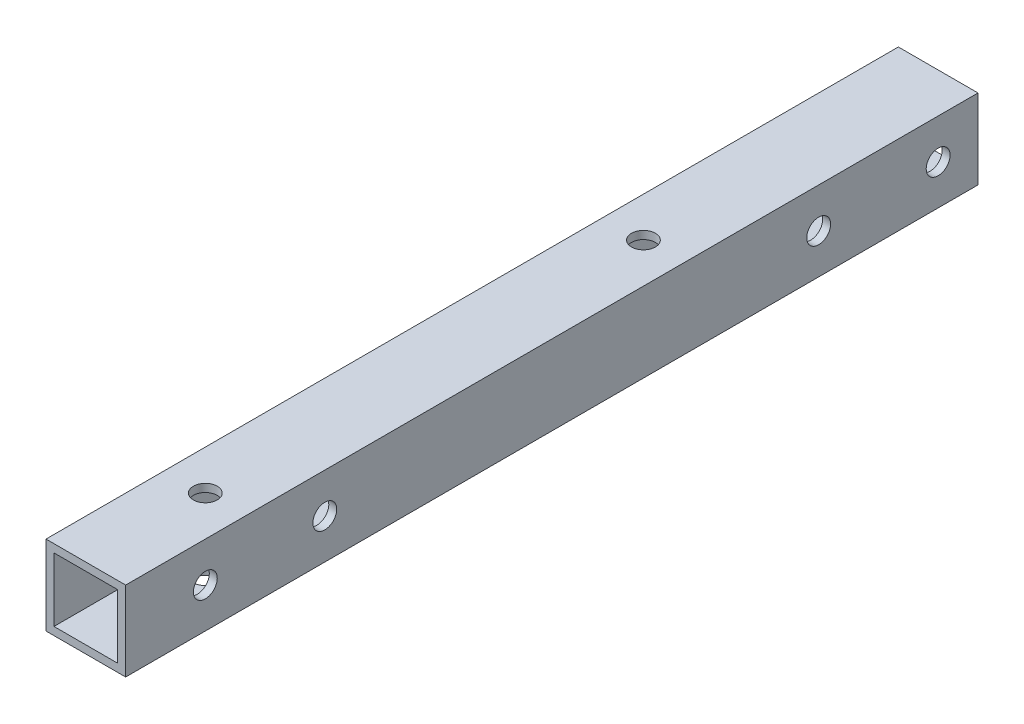
ISO-10303-21;
HEADER;
FILE_DESCRIPTION(('STEP AP214'),'2;1');
FILE_NAME('part.step','',(''),(''),'','','');
FILE_SCHEMA(('AUTOMOTIVE_DESIGN { 1 0 10303 214 1 1 1 1 }'));
ENDSEC;
DATA;
#1=APPLICATION_CONTEXT('core data for automotive mechanical design processes');
#2=APPLICATION_PROTOCOL_DEFINITION('international standard','automotive_design',2000,#1);
#3=PRODUCT_CONTEXT('',#1,'mechanical');
#4=PRODUCT('Part','Part','',(#3));
#5=PRODUCT_RELATED_PRODUCT_CATEGORY('part','',(#4));
#6=PRODUCT_DEFINITION_FORMATION('','',#4);
#7=PRODUCT_DEFINITION_CONTEXT('part definition',#1,'design');
#8=PRODUCT_DEFINITION('design','',#6,#7);
#9=PRODUCT_DEFINITION_SHAPE('','',#8);
#10=(LENGTH_UNIT() NAMED_UNIT(*) SI_UNIT(.MILLI.,.METRE.));
#11=(NAMED_UNIT(*) PLANE_ANGLE_UNIT() SI_UNIT($,.RADIAN.));
#12=(NAMED_UNIT(*) SI_UNIT($,.STERADIAN.) SOLID_ANGLE_UNIT());
#13=UNCERTAINTY_MEASURE_WITH_UNIT(LENGTH_MEASURE(1.E-05),#10,'distance_accuracy_value','');
#14=(GEOMETRIC_REPRESENTATION_CONTEXT(3) GLOBAL_UNCERTAINTY_ASSIGNED_CONTEXT((#13)) GLOBAL_UNIT_ASSIGNED_CONTEXT((#10,
#11,#12)) REPRESENTATION_CONTEXT('',''));
#15=CARTESIAN_POINT('',(0.,0.,0.));
#16=DIRECTION('',(0.,0.,1.));
#17=DIRECTION('',(1.,0.,0.));
#18=AXIS2_PLACEMENT_3D('',#15,#16,#17);
#19=CARTESIAN_POINT('',(0.,0.,107.));
#20=DIRECTION('',(0.,0.,1.));
#21=DIRECTION('',(1.,0.,0.));
#22=AXIS2_PLACEMENT_3D('',#19,#20,#21);
#23=PLANE('',#22);
#24=DIRECTION('',(0.,-1.,0.));
#25=VECTOR('',#24,1.);
#26=CARTESIAN_POINT('',(-5.,-5.,107.));
#27=LINE('',#26,#25);
#28=CARTESIAN_POINT('',(-5.,5.,107.));
#29=VERTEX_POINT('',#28);
#30=CARTESIAN_POINT('',(-5.,-5.,107.));
#31=VERTEX_POINT('',#30);
#32=EDGE_CURVE('E172',#29,#31,#27,.T.);
#33=ORIENTED_EDGE('',*,*,#32,.T.);
#34=DIRECTION('',(1.,0.,0.));
#35=VECTOR('',#34,1.);
#36=CARTESIAN_POINT('',(-5.,-5.,107.));
#37=LINE('',#36,#35);
#38=CARTESIAN_POINT('',(5.,-5.,107.));
#39=VERTEX_POINT('',#38);
#40=EDGE_CURVE('E175',#31,#39,#37,.T.);
#41=ORIENTED_EDGE('',*,*,#40,.T.);
#42=DIRECTION('',(0.,1.,0.));
#43=VECTOR('',#42,1.);
#44=CARTESIAN_POINT('',(5.,-5.,107.));
#45=LINE('',#44,#43);
#46=CARTESIAN_POINT('',(5.,5.,107.));
#47=VERTEX_POINT('',#46);
#48=EDGE_CURVE('E178',#39,#47,#45,.T.);
#49=ORIENTED_EDGE('',*,*,#48,.T.);
#50=DIRECTION('',(-1.,0.,0.));
#51=VECTOR('',#50,1.);
#52=CARTESIAN_POINT('',(-5.,5.,107.));
#53=LINE('',#52,#51);
#54=EDGE_CURVE('E180',#47,#29,#53,.T.);
#55=ORIENTED_EDGE('',*,*,#54,.T.);
#56=EDGE_LOOP('',(#33,#41,#49,#55));
#57=FACE_BOUND('',#56,.T.);
#58=DIRECTION('',(1.,0.,0.));
#59=VECTOR('',#58,1.);
#60=CARTESIAN_POINT('',(0.,-4.,107.));
#61=LINE('',#60,#59);
#62=CARTESIAN_POINT('',(-4.,-4.,107.));
#63=VERTEX_POINT('',#62);
#64=CARTESIAN_POINT('',(4.,-4.,107.));
#65=VERTEX_POINT('',#64);
#66=EDGE_CURVE('E142',#63,#65,#61,.T.);
#67=ORIENTED_EDGE('',*,*,#66,.F.);
#68=DIRECTION('',(0.,-1.,0.));
#69=VECTOR('',#68,1.);
#70=CARTESIAN_POINT('',(-4.,0.,107.));
#71=LINE('',#70,#69);
#72=CARTESIAN_POINT('',(-4.,4.,107.));
#73=VERTEX_POINT('',#72);
#74=EDGE_CURVE('E134',#73,#63,#71,.T.);
#75=ORIENTED_EDGE('',*,*,#74,.F.);
#76=DIRECTION('',(-1.,0.,0.));
#77=VECTOR('',#76,1.);
#78=CARTESIAN_POINT('',(0.,4.,107.));
#79=LINE('',#78,#77);
#80=CARTESIAN_POINT('',(4.,4.,107.));
#81=VERTEX_POINT('',#80);
#82=EDGE_CURVE('E156',#81,#73,#79,.T.);
#83=ORIENTED_EDGE('',*,*,#82,.F.);
#84=DIRECTION('',(0.,1.,0.));
#85=VECTOR('',#84,1.);
#86=CARTESIAN_POINT('',(4.,0.,107.));
#87=LINE('',#86,#85);
#88=EDGE_CURVE('E154',#65,#81,#87,.T.);
#89=ORIENTED_EDGE('',*,*,#88,.F.);
#90=EDGE_LOOP('',(#67,#75,#83,#89));
#91=FACE_BOUND('',#90,.T.);
#92=ADVANCED_FACE('F67',(#57,#91),#23,.T.);
#93=CARTESIAN_POINT('',(0.,0.,0.));
#94=DIRECTION('',(0.,0.,1.));
#95=DIRECTION('',(1.,0.,0.));
#96=AXIS2_PLACEMENT_3D('',#93,#94,#95);
#97=PLANE('',#96);
#98=DIRECTION('',(0.,-1.,0.));
#99=VECTOR('',#98,1.);
#100=CARTESIAN_POINT('',(-5.,-5.,0.));
#101=LINE('',#100,#99);
#102=CARTESIAN_POINT('',(-5.,5.,0.));
#103=VERTEX_POINT('',#102);
#104=CARTESIAN_POINT('',(-5.,-5.,0.));
#105=VERTEX_POINT('',#104);
#106=EDGE_CURVE('E150',#103,#105,#101,.T.);
#107=ORIENTED_EDGE('',*,*,#106,.F.);
#108=DIRECTION('',(-1.,0.,0.));
#109=VECTOR('',#108,1.);
#110=CARTESIAN_POINT('',(-5.,5.,0.));
#111=LINE('',#110,#109);
#112=CARTESIAN_POINT('',(5.,5.,0.));
#113=VERTEX_POINT('',#112);
#114=EDGE_CURVE('E176',#113,#103,#111,.T.);
#115=ORIENTED_EDGE('',*,*,#114,.F.);
#116=DIRECTION('',(0.,1.,0.));
#117=VECTOR('',#116,1.);
#118=CARTESIAN_POINT('',(5.,-5.,0.));
#119=LINE('',#118,#117);
#120=CARTESIAN_POINT('',(5.,-5.,0.));
#121=VERTEX_POINT('',#120);
#122=EDGE_CURVE('E187',#121,#113,#119,.T.);
#123=ORIENTED_EDGE('',*,*,#122,.F.);
#124=DIRECTION('',(1.,0.,0.));
#125=VECTOR('',#124,1.);
#126=CARTESIAN_POINT('',(-5.,-5.,0.));
#127=LINE('',#126,#125);
#128=EDGE_CURVE('E185',#105,#121,#127,.T.);
#129=ORIENTED_EDGE('',*,*,#128,.F.);
#130=EDGE_LOOP('',(#107,#115,#123,#129));
#131=FACE_BOUND('',#130,.T.);
#132=DIRECTION('',(0.,-1.,0.));
#133=VECTOR('',#132,1.);
#134=CARTESIAN_POINT('',(-4.,0.,0.));
#135=LINE('',#134,#133);
#136=CARTESIAN_POINT('',(-4.,4.,0.));
#137=VERTEX_POINT('',#136);
#138=CARTESIAN_POINT('',(-4.,-4.,0.));
#139=VERTEX_POINT('',#138);
#140=EDGE_CURVE('E92',#137,#139,#135,.T.);
#141=ORIENTED_EDGE('',*,*,#140,.T.);
#142=DIRECTION('',(1.,0.,0.));
#143=VECTOR('',#142,1.);
#144=CARTESIAN_POINT('',(0.,-4.,0.));
#145=LINE('',#144,#143);
#146=CARTESIAN_POINT('',(4.,-4.,0.));
#147=VERTEX_POINT('',#146);
#148=EDGE_CURVE('E149',#139,#147,#145,.T.);
#149=ORIENTED_EDGE('',*,*,#148,.T.);
#150=DIRECTION('',(0.,1.,0.));
#151=VECTOR('',#150,1.);
#152=CARTESIAN_POINT('',(4.,0.,0.));
#153=LINE('',#152,#151);
#154=CARTESIAN_POINT('',(4.,4.,0.));
#155=VERTEX_POINT('',#154);
#156=EDGE_CURVE('E164',#147,#155,#153,.T.);
#157=ORIENTED_EDGE('',*,*,#156,.T.);
#158=DIRECTION('',(-1.,0.,0.));
#159=VECTOR('',#158,1.);
#160=CARTESIAN_POINT('',(0.,4.,0.));
#161=LINE('',#160,#159);
#162=EDGE_CURVE('E143',#155,#137,#161,.T.);
#163=ORIENTED_EDGE('',*,*,#162,.T.);
#164=EDGE_LOOP('',(#141,#149,#157,#163));
#165=FACE_BOUND('',#164,.T.);
#166=ADVANCED_FACE('F293',(#131,#165),#97,.F.);
#167=CARTESIAN_POINT('',(-5.,-5.,107.));
#168=DIRECTION('',(1.,0.,0.));
#169=DIRECTION('',(0.,0.,-1.));
#170=AXIS2_PLACEMENT_3D('',#167,#168,#169);
#171=PLANE('',#170);
#172=CARTESIAN_POINT('',(-5.,0.,5.));
#173=DIRECTION('',(1.,0.,0.));
#174=DIRECTION('',(0.,0.,-1.));
#175=AXIS2_PLACEMENT_3D('',#172,#173,#174);
#176=CIRCLE('',#175,1.5);
#177=CARTESIAN_POINT('',(-5.,0.,3.5));
#178=VERTEX_POINT('',#177);
#179=EDGE_CURVE('E201',#178,#178,#176,.T.);
#180=ORIENTED_EDGE('',*,*,#179,.T.);
#181=EDGE_LOOP('',(#180));
#182=FACE_BOUND('',#181,.T.);
#183=CARTESIAN_POINT('',(-5.,0.,82.));
#184=DIRECTION('',(1.,0.,0.));
#185=DIRECTION('',(0.,0.,-1.));
#186=AXIS2_PLACEMENT_3D('',#183,#184,#185);
#187=CIRCLE('',#186,1.5);
#188=CARTESIAN_POINT('',(-5.,0.,80.5));
#189=VERTEX_POINT('',#188);
#190=EDGE_CURVE('E237',#189,#189,#187,.T.);
#191=ORIENTED_EDGE('',*,*,#190,.T.);
#192=EDGE_LOOP('',(#191));
#193=FACE_BOUND('',#192,.T.);
#194=CARTESIAN_POINT('',(-5.,0.,97.));
#195=DIRECTION('',(1.,0.,0.));
#196=DIRECTION('',(0.,0.,-1.));
#197=AXIS2_PLACEMENT_3D('',#194,#195,#196);
#198=CIRCLE('',#197,1.5);
#199=CARTESIAN_POINT('',(-5.,0.,95.5));
#200=VERTEX_POINT('',#199);
#201=EDGE_CURVE('E247',#200,#200,#198,.T.);
#202=ORIENTED_EDGE('',*,*,#201,.T.);
#203=EDGE_LOOP('',(#202));
#204=FACE_BOUND('',#203,.T.);
#205=CARTESIAN_POINT('',(-5.,0.,20.));
#206=DIRECTION('',(1.,0.,0.));
#207=DIRECTION('',(0.,0.,-1.));
#208=AXIS2_PLACEMENT_3D('',#205,#206,#207);
#209=CIRCLE('',#208,1.5);
#210=CARTESIAN_POINT('',(-5.,0.,18.5));
#211=VERTEX_POINT('',#210);
#212=EDGE_CURVE('E252',#211,#211,#209,.T.);
#213=ORIENTED_EDGE('',*,*,#212,.T.);
#214=EDGE_LOOP('',(#213));
#215=FACE_BOUND('',#214,.T.);
#216=ORIENTED_EDGE('',*,*,#106,.T.);
#217=DIRECTION('',(0.,0.,-1.));
#218=VECTOR('',#217,1.);
#219=CARTESIAN_POINT('',(-5.,-5.,107.));
#220=LINE('',#219,#218);
#221=EDGE_CURVE('E12',#31,#105,#220,.T.);
#222=ORIENTED_EDGE('',*,*,#221,.F.);
#223=ORIENTED_EDGE('',*,*,#32,.F.);
#224=DIRECTION('',(0.,0.,-1.));
#225=VECTOR('',#224,1.);
#226=CARTESIAN_POINT('',(-5.,5.,107.));
#227=LINE('',#226,#225);
#228=EDGE_CURVE('E182',#29,#103,#227,.T.);
#229=ORIENTED_EDGE('',*,*,#228,.T.);
#230=EDGE_LOOP('',(#216,#222,#223,#229));
#231=FACE_BOUND('',#230,.T.);
#232=ADVANCED_FACE('F69',(#182,#193,#204,#215,#231),#171,.F.);
#233=CARTESIAN_POINT('',(-5.,-5.,107.));
#234=DIRECTION('',(0.,1.,0.));
#235=DIRECTION('',(0.,0.,1.));
#236=AXIS2_PLACEMENT_3D('',#233,#234,#235);
#237=PLANE('',#236);
#238=CARTESIAN_POINT('',(0.,-5.,92.));
#239=DIRECTION('',(0.,-1.,0.));
#240=DIRECTION('',(0.,0.,-1.));
#241=AXIS2_PLACEMENT_3D('',#238,#239,#240);
#242=CIRCLE('',#241,1.5);
#243=CARTESIAN_POINT('',(0.,-5.,90.5));
#244=VERTEX_POINT('',#243);
#245=EDGE_CURVE('E221',#244,#244,#242,.T.);
#246=ORIENTED_EDGE('',*,*,#245,.F.);
#247=EDGE_LOOP('',(#246));
#248=FACE_BOUND('',#247,.T.);
#249=CARTESIAN_POINT('',(0.,-5.,37.));
#250=DIRECTION('',(0.,-1.,0.));
#251=DIRECTION('',(0.,0.,-1.));
#252=AXIS2_PLACEMENT_3D('',#249,#250,#251);
#253=CIRCLE('',#252,1.5);
#254=CARTESIAN_POINT('',(0.,-5.,35.5));
#255=VERTEX_POINT('',#254);
#256=EDGE_CURVE('E226',#255,#255,#253,.T.);
#257=ORIENTED_EDGE('',*,*,#256,.F.);
#258=EDGE_LOOP('',(#257));
#259=FACE_BOUND('',#258,.T.);
#260=ORIENTED_EDGE('',*,*,#128,.T.);
#261=DIRECTION('',(0.,0.,-1.));
#262=VECTOR('',#261,1.);
#263=CARTESIAN_POINT('',(5.,-5.,107.));
#264=LINE('',#263,#262);
#265=EDGE_CURVE('E76',#39,#121,#264,.T.);
#266=ORIENTED_EDGE('',*,*,#265,.F.);
#267=ORIENTED_EDGE('',*,*,#40,.F.);
#268=ORIENTED_EDGE('',*,*,#221,.T.);
#269=EDGE_LOOP('',(#260,#266,#267,#268));
#270=FACE_BOUND('',#269,.T.);
#271=ADVANCED_FACE('F292',(#248,#259,#270),#237,.F.);
#272=CARTESIAN_POINT('',(5.,-5.,107.));
#273=DIRECTION('',(-1.,0.,0.));
#274=DIRECTION('',(0.,0.,1.));
#275=AXIS2_PLACEMENT_3D('',#272,#273,#274);
#276=PLANE('',#275);
#277=CARTESIAN_POINT('',(5.,0.,5.));
#278=DIRECTION('',(1.,0.,0.));
#279=DIRECTION('',(0.,0.,-1.));
#280=AXIS2_PLACEMENT_3D('',#277,#278,#279);
#281=CIRCLE('',#280,1.5);
#282=CARTESIAN_POINT('',(5.,0.,3.5));
#283=VERTEX_POINT('',#282);
#284=EDGE_CURVE('E240',#283,#283,#281,.T.);
#285=ORIENTED_EDGE('',*,*,#284,.F.);
#286=EDGE_LOOP('',(#285));
#287=FACE_BOUND('',#286,.T.);
#288=CARTESIAN_POINT('',(5.,0.,82.));
#289=DIRECTION('',(1.,0.,0.));
#290=DIRECTION('',(0.,0.,-1.));
#291=AXIS2_PLACEMENT_3D('',#288,#289,#290);
#292=CIRCLE('',#291,1.5);
#293=CARTESIAN_POINT('',(5.,0.,80.5));
#294=VERTEX_POINT('',#293);
#295=EDGE_CURVE('E244',#294,#294,#292,.T.);
#296=ORIENTED_EDGE('',*,*,#295,.F.);
#297=EDGE_LOOP('',(#296));
#298=FACE_BOUND('',#297,.T.);
#299=CARTESIAN_POINT('',(5.,0.,97.));
#300=DIRECTION('',(1.,0.,0.));
#301=DIRECTION('',(0.,0.,-1.));
#302=AXIS2_PLACEMENT_3D('',#299,#300,#301);
#303=CIRCLE('',#302,1.5);
#304=CARTESIAN_POINT('',(5.,0.,95.5));
#305=VERTEX_POINT('',#304);
#306=EDGE_CURVE('E255',#305,#305,#303,.T.);
#307=ORIENTED_EDGE('',*,*,#306,.F.);
#308=EDGE_LOOP('',(#307));
#309=FACE_BOUND('',#308,.T.);
#310=CARTESIAN_POINT('',(5.,0.,20.));
#311=DIRECTION('',(1.,0.,0.));
#312=DIRECTION('',(0.,0.,-1.));
#313=AXIS2_PLACEMENT_3D('',#310,#311,#312);
#314=CIRCLE('',#313,1.5);
#315=CARTESIAN_POINT('',(5.,0.,18.5));
#316=VERTEX_POINT('',#315);
#317=EDGE_CURVE('E243',#316,#316,#314,.T.);
#318=ORIENTED_EDGE('',*,*,#317,.F.);
#319=EDGE_LOOP('',(#318));
#320=FACE_BOUND('',#319,.T.);
#321=ORIENTED_EDGE('',*,*,#122,.T.);
#322=DIRECTION('',(0.,0.,-1.));
#323=VECTOR('',#322,1.);
#324=CARTESIAN_POINT('',(5.,5.,107.));
#325=LINE('',#324,#323);
#326=EDGE_CURVE('E192',#47,#113,#325,.T.);
#327=ORIENTED_EDGE('',*,*,#326,.F.);
#328=ORIENTED_EDGE('',*,*,#48,.F.);
#329=ORIENTED_EDGE('',*,*,#265,.T.);
#330=EDGE_LOOP('',(#321,#327,#328,#329));
#331=FACE_BOUND('',#330,.T.);
#332=ADVANCED_FACE('F311',(#287,#298,#309,#320,#331),#276,.F.);
#333=CARTESIAN_POINT('',(-5.,5.,107.));
#334=DIRECTION('',(0.,-1.,0.));
#335=DIRECTION('',(0.,0.,-1.));
#336=AXIS2_PLACEMENT_3D('',#333,#334,#335);
#337=PLANE('',#336);
#338=CARTESIAN_POINT('',(0.,5.,92.));
#339=DIRECTION('',(0.,-1.,0.));
#340=DIRECTION('',(0.,0.,-1.));
#341=AXIS2_PLACEMENT_3D('',#338,#339,#340);
#342=CIRCLE('',#341,1.5);
#343=CARTESIAN_POINT('',(0.,5.,90.5));
#344=VERTEX_POINT('',#343);
#345=EDGE_CURVE('E215',#344,#344,#342,.T.);
#346=ORIENTED_EDGE('',*,*,#345,.T.);
#347=EDGE_LOOP('',(#346));
#348=FACE_BOUND('',#347,.T.);
#349=CARTESIAN_POINT('',(0.,5.,37.));
#350=DIRECTION('',(0.,-1.,0.));
#351=DIRECTION('',(0.,0.,-1.));
#352=AXIS2_PLACEMENT_3D('',#349,#350,#351);
#353=CIRCLE('',#352,1.5);
#354=CARTESIAN_POINT('',(0.,5.,35.5));
#355=VERTEX_POINT('',#354);
#356=EDGE_CURVE('E231',#355,#355,#353,.T.);
#357=ORIENTED_EDGE('',*,*,#356,.T.);
#358=EDGE_LOOP('',(#357));
#359=FACE_BOUND('',#358,.T.);
#360=ORIENTED_EDGE('',*,*,#114,.T.);
#361=ORIENTED_EDGE('',*,*,#228,.F.);
#362=ORIENTED_EDGE('',*,*,#54,.F.);
#363=ORIENTED_EDGE('',*,*,#326,.T.);
#364=EDGE_LOOP('',(#360,#361,#362,#363));
#365=FACE_BOUND('',#364,.T.);
#366=ADVANCED_FACE('F273',(#348,#359,#365),#337,.F.);
#367=CARTESIAN_POINT('',(-4.,0.,107.));
#368=DIRECTION('',(1.,0.,0.));
#369=DIRECTION('',(0.,0.,-1.));
#370=AXIS2_PLACEMENT_3D('',#367,#368,#369);
#371=PLANE('',#370);
#372=CARTESIAN_POINT('',(-4.,0.,5.));
#373=DIRECTION('',(1.,0.,0.));
#374=DIRECTION('',(0.,0.,-1.));
#375=AXIS2_PLACEMENT_3D('',#372,#373,#374);
#376=CIRCLE('',#375,1.5);
#377=CARTESIAN_POINT('',(-4.,0.,3.5));
#378=VERTEX_POINT('',#377);
#379=EDGE_CURVE('E162',#378,#378,#376,.T.);
#380=ORIENTED_EDGE('',*,*,#379,.F.);
#381=EDGE_LOOP('',(#380));
#382=FACE_BOUND('',#381,.T.);
#383=CARTESIAN_POINT('',(-4.,0.,82.));
#384=DIRECTION('',(1.,0.,0.));
#385=DIRECTION('',(0.,0.,-1.));
#386=AXIS2_PLACEMENT_3D('',#383,#384,#385);
#387=CIRCLE('',#386,1.5);
#388=CARTESIAN_POINT('',(-4.,0.,80.5));
#389=VERTEX_POINT('',#388);
#390=EDGE_CURVE('E209',#389,#389,#387,.T.);
#391=ORIENTED_EDGE('',*,*,#390,.F.);
#392=EDGE_LOOP('',(#391));
#393=FACE_BOUND('',#392,.T.);
#394=CARTESIAN_POINT('',(-4.,0.,97.));
#395=DIRECTION('',(1.,0.,0.));
#396=DIRECTION('',(0.,0.,-1.));
#397=AXIS2_PLACEMENT_3D('',#394,#395,#396);
#398=CIRCLE('',#397,1.5);
#399=CARTESIAN_POINT('',(-4.,0.,95.5));
#400=VERTEX_POINT('',#399);
#401=EDGE_CURVE('E205',#400,#400,#398,.T.);
#402=ORIENTED_EDGE('',*,*,#401,.F.);
#403=EDGE_LOOP('',(#402));
#404=FACE_BOUND('',#403,.T.);
#405=CARTESIAN_POINT('',(-4.,0.,20.));
#406=DIRECTION('',(1.,0.,0.));
#407=DIRECTION('',(0.,0.,-1.));
#408=AXIS2_PLACEMENT_3D('',#405,#406,#407);
#409=CIRCLE('',#408,1.5);
#410=CARTESIAN_POINT('',(-4.,0.,18.5));
#411=VERTEX_POINT('',#410);
#412=EDGE_CURVE('E200',#411,#411,#409,.T.);
#413=ORIENTED_EDGE('',*,*,#412,.F.);
#414=EDGE_LOOP('',(#413));
#415=FACE_BOUND('',#414,.T.);
#416=ORIENTED_EDGE('',*,*,#140,.F.);
#417=DIRECTION('',(0.,0.,-1.));
#418=VECTOR('',#417,1.);
#419=CARTESIAN_POINT('',(-4.,4.,107.));
#420=LINE('',#419,#418);
#421=EDGE_CURVE('E138',#73,#137,#420,.T.);
#422=ORIENTED_EDGE('',*,*,#421,.F.);
#423=ORIENTED_EDGE('',*,*,#74,.T.);
#424=DIRECTION('',(0.,0.,-1.));
#425=VECTOR('',#424,1.);
#426=CARTESIAN_POINT('',(-4.,-4.,107.));
#427=LINE('',#426,#425);
#428=EDGE_CURVE('E137',#63,#139,#427,.T.);
#429=ORIENTED_EDGE('',*,*,#428,.T.);
#430=EDGE_LOOP('',(#416,#422,#423,#429));
#431=FACE_BOUND('',#430,.T.);
#432=ADVANCED_FACE('F136',(#382,#393,#404,#415,#431),#371,.T.);
#433=CARTESIAN_POINT('',(0.,-4.,107.));
#434=DIRECTION('',(0.,1.,0.));
#435=DIRECTION('',(0.,0.,1.));
#436=AXIS2_PLACEMENT_3D('',#433,#434,#435);
#437=PLANE('',#436);
#438=CARTESIAN_POINT('',(0.,-4.00000000000001,92.));
#439=DIRECTION('',(0.,1.,0.));
#440=DIRECTION('',(0.,0.,1.));
#441=AXIS2_PLACEMENT_3D('',#438,#439,#440);
#442=CIRCLE('',#441,1.5);
#443=CARTESIAN_POINT('',(0.,-4.00000000000001,93.5));
#444=VERTEX_POINT('',#443);
#445=EDGE_CURVE('E234',#444,#444,#442,.T.);
#446=ORIENTED_EDGE('',*,*,#445,.F.);
#447=EDGE_LOOP('',(#446));
#448=FACE_BOUND('',#447,.T.);
#449=CARTESIAN_POINT('',(0.,-4.00000000000001,37.));
#450=DIRECTION('',(0.,1.,0.));
#451=DIRECTION('',(0.,0.,1.));
#452=AXIS2_PLACEMENT_3D('',#449,#450,#451);
#453=CIRCLE('',#452,1.5);
#454=CARTESIAN_POINT('',(0.,-4.00000000000001,38.5));
#455=VERTEX_POINT('',#454);
#456=EDGE_CURVE('E214',#455,#455,#453,.T.);
#457=ORIENTED_EDGE('',*,*,#456,.F.);
#458=EDGE_LOOP('',(#457));
#459=FACE_BOUND('',#458,.T.);
#460=ORIENTED_EDGE('',*,*,#148,.F.);
#461=ORIENTED_EDGE('',*,*,#428,.F.);
#462=ORIENTED_EDGE('',*,*,#66,.T.);
#463=DIRECTION('',(0.,0.,-1.));
#464=VECTOR('',#463,1.);
#465=CARTESIAN_POINT('',(4.,-4.,107.));
#466=LINE('',#465,#464);
#467=EDGE_CURVE('E151',#65,#147,#466,.T.);
#468=ORIENTED_EDGE('',*,*,#467,.T.);
#469=EDGE_LOOP('',(#460,#461,#462,#468));
#470=FACE_BOUND('',#469,.T.);
#471=ADVANCED_FACE('F146',(#448,#459,#470),#437,.T.);
#472=CARTESIAN_POINT('',(4.,0.,107.));
#473=DIRECTION('',(-1.,0.,0.));
#474=DIRECTION('',(0.,0.,1.));
#475=AXIS2_PLACEMENT_3D('',#472,#473,#474);
#476=PLANE('',#475);
#477=CARTESIAN_POINT('',(4.,0.,5.));
#478=DIRECTION('',(-1.,0.,0.));
#479=DIRECTION('',(0.,0.,1.));
#480=AXIS2_PLACEMENT_3D('',#477,#478,#479);
#481=CIRCLE('',#480,1.5);
#482=CARTESIAN_POINT('',(4.,0.,6.5));
#483=VERTEX_POINT('',#482);
#484=EDGE_CURVE('E210',#483,#483,#481,.T.);
#485=ORIENTED_EDGE('',*,*,#484,.F.);
#486=EDGE_LOOP('',(#485));
#487=FACE_BOUND('',#486,.T.);
#488=CARTESIAN_POINT('',(4.,0.,82.));
#489=DIRECTION('',(-1.,0.,0.));
#490=DIRECTION('',(0.,0.,1.));
#491=AXIS2_PLACEMENT_3D('',#488,#489,#490);
#492=CIRCLE('',#491,1.5);
#493=CARTESIAN_POINT('',(4.,0.,83.5));
#494=VERTEX_POINT('',#493);
#495=EDGE_CURVE('E206',#494,#494,#492,.T.);
#496=ORIENTED_EDGE('',*,*,#495,.F.);
#497=EDGE_LOOP('',(#496));
#498=FACE_BOUND('',#497,.T.);
#499=CARTESIAN_POINT('',(4.,0.,97.));
#500=DIRECTION('',(-1.,0.,0.));
#501=DIRECTION('',(0.,0.,1.));
#502=AXIS2_PLACEMENT_3D('',#499,#500,#501);
#503=CIRCLE('',#502,1.5);
#504=CARTESIAN_POINT('',(4.,0.,98.5));
#505=VERTEX_POINT('',#504);
#506=EDGE_CURVE('E202',#505,#505,#503,.T.);
#507=ORIENTED_EDGE('',*,*,#506,.F.);
#508=EDGE_LOOP('',(#507));
#509=FACE_BOUND('',#508,.T.);
#510=CARTESIAN_POINT('',(4.,0.,20.));
#511=DIRECTION('',(-1.,0.,0.));
#512=DIRECTION('',(0.,0.,1.));
#513=AXIS2_PLACEMENT_3D('',#510,#511,#512);
#514=CIRCLE('',#513,1.5);
#515=CARTESIAN_POINT('',(4.,0.,21.5));
#516=VERTEX_POINT('',#515);
#517=EDGE_CURVE('E197',#516,#516,#514,.T.);
#518=ORIENTED_EDGE('',*,*,#517,.F.);
#519=EDGE_LOOP('',(#518));
#520=FACE_BOUND('',#519,.T.);
#521=ORIENTED_EDGE('',*,*,#156,.F.);
#522=ORIENTED_EDGE('',*,*,#467,.F.);
#523=ORIENTED_EDGE('',*,*,#88,.T.);
#524=DIRECTION('',(0.,0.,-1.));
#525=VECTOR('',#524,1.);
#526=CARTESIAN_POINT('',(4.,4.,107.));
#527=LINE('',#526,#525);
#528=EDGE_CURVE('E84',#81,#155,#527,.T.);
#529=ORIENTED_EDGE('',*,*,#528,.T.);
#530=EDGE_LOOP('',(#521,#522,#523,#529));
#531=FACE_BOUND('',#530,.T.);
#532=ADVANCED_FACE('F332',(#487,#498,#509,#520,#531),#476,.T.);
#533=CARTESIAN_POINT('',(0.,4.,107.));
#534=DIRECTION('',(0.,-1.,0.));
#535=DIRECTION('',(0.,0.,-1.));
#536=AXIS2_PLACEMENT_3D('',#533,#534,#535);
#537=PLANE('',#536);
#538=CARTESIAN_POINT('',(0.,4.,92.));
#539=DIRECTION('',(0.,-1.,0.));
#540=DIRECTION('',(0.,0.,-1.));
#541=AXIS2_PLACEMENT_3D('',#538,#539,#540);
#542=CIRCLE('',#541,1.5);
#543=CARTESIAN_POINT('',(0.,4.,90.5));
#544=VERTEX_POINT('',#543);
#545=EDGE_CURVE('E71',#544,#544,#542,.T.);
#546=ORIENTED_EDGE('',*,*,#545,.F.);
#547=EDGE_LOOP('',(#546));
#548=FACE_BOUND('',#547,.T.);
#549=CARTESIAN_POINT('',(0.,4.,37.));
#550=DIRECTION('',(0.,-1.,0.));
#551=DIRECTION('',(0.,0.,-1.));
#552=AXIS2_PLACEMENT_3D('',#549,#550,#551);
#553=CIRCLE('',#552,1.5);
#554=CARTESIAN_POINT('',(0.,4.,35.5));
#555=VERTEX_POINT('',#554);
#556=EDGE_CURVE('E212',#555,#555,#553,.T.);
#557=ORIENTED_EDGE('',*,*,#556,.F.);
#558=EDGE_LOOP('',(#557));
#559=FACE_BOUND('',#558,.T.);
#560=ORIENTED_EDGE('',*,*,#162,.F.);
#561=ORIENTED_EDGE('',*,*,#528,.F.);
#562=ORIENTED_EDGE('',*,*,#82,.T.);
#563=ORIENTED_EDGE('',*,*,#421,.T.);
#564=EDGE_LOOP('',(#560,#561,#562,#563));
#565=FACE_BOUND('',#564,.T.);
#566=ADVANCED_FACE('F336',(#548,#559,#565),#537,.T.);
#567=CARTESIAN_POINT('',(-5.,0.,20.));
#568=DIRECTION('',(1.,0.,0.));
#569=DIRECTION('',(0.,0.,-1.));
#570=AXIS2_PLACEMENT_3D('',#567,#568,#569);
#571=CYLINDRICAL_SURFACE('',#570,1.5);
#572=ORIENTED_EDGE('',*,*,#517,.T.);
#573=EDGE_LOOP('',(#572));
#574=FACE_BOUND('',#573,.T.);
#575=ORIENTED_EDGE('',*,*,#317,.T.);
#576=EDGE_LOOP('',(#575));
#577=FACE_BOUND('',#576,.T.);
#578=ADVANCED_FACE('F287',(#574,#577),#571,.F.);
#579=CARTESIAN_POINT('',(-5.,0.,97.));
#580=DIRECTION('',(1.,0.,0.));
#581=DIRECTION('',(0.,0.,-1.));
#582=AXIS2_PLACEMENT_3D('',#579,#580,#581);
#583=CYLINDRICAL_SURFACE('',#582,1.5);
#584=ORIENTED_EDGE('',*,*,#506,.T.);
#585=EDGE_LOOP('',(#584));
#586=FACE_BOUND('',#585,.T.);
#587=ORIENTED_EDGE('',*,*,#306,.T.);
#588=EDGE_LOOP('',(#587));
#589=FACE_BOUND('',#588,.T.);
#590=ADVANCED_FACE('F341',(#586,#589),#583,.F.);
#591=CARTESIAN_POINT('',(-5.,0.,82.));
#592=DIRECTION('',(1.,0.,0.));
#593=DIRECTION('',(0.,0.,-1.));
#594=AXIS2_PLACEMENT_3D('',#591,#592,#593);
#595=CYLINDRICAL_SURFACE('',#594,1.5);
#596=ORIENTED_EDGE('',*,*,#495,.T.);
#597=EDGE_LOOP('',(#596));
#598=FACE_BOUND('',#597,.T.);
#599=ORIENTED_EDGE('',*,*,#295,.T.);
#600=EDGE_LOOP('',(#599));
#601=FACE_BOUND('',#600,.T.);
#602=ADVANCED_FACE('F343',(#598,#601),#595,.F.);
#603=CARTESIAN_POINT('',(-5.,0.,5.));
#604=DIRECTION('',(1.,0.,0.));
#605=DIRECTION('',(0.,0.,-1.));
#606=AXIS2_PLACEMENT_3D('',#603,#604,#605);
#607=CYLINDRICAL_SURFACE('',#606,1.5);
#608=ORIENTED_EDGE('',*,*,#484,.T.);
#609=EDGE_LOOP('',(#608));
#610=FACE_BOUND('',#609,.T.);
#611=ORIENTED_EDGE('',*,*,#284,.T.);
#612=EDGE_LOOP('',(#611));
#613=FACE_BOUND('',#612,.T.);
#614=ADVANCED_FACE('F285',(#610,#613),#607,.F.);
#615=ORIENTED_EDGE('',*,*,#412,.T.);
#616=EDGE_LOOP('',(#615));
#617=FACE_BOUND('',#616,.T.);
#618=ORIENTED_EDGE('',*,*,#212,.F.);
#619=EDGE_LOOP('',(#618));
#620=FACE_BOUND('',#619,.T.);
#621=ADVANCED_FACE('F281',(#617,#620),#571,.F.);
#622=ORIENTED_EDGE('',*,*,#401,.T.);
#623=EDGE_LOOP('',(#622));
#624=FACE_BOUND('',#623,.T.);
#625=ORIENTED_EDGE('',*,*,#201,.F.);
#626=EDGE_LOOP('',(#625));
#627=FACE_BOUND('',#626,.T.);
#628=ADVANCED_FACE('F284',(#624,#627),#583,.F.);
#629=ORIENTED_EDGE('',*,*,#390,.T.);
#630=EDGE_LOOP('',(#629));
#631=FACE_BOUND('',#630,.T.);
#632=ORIENTED_EDGE('',*,*,#190,.F.);
#633=EDGE_LOOP('',(#632));
#634=FACE_BOUND('',#633,.T.);
#635=ADVANCED_FACE('F351',(#631,#634),#595,.F.);
#636=ORIENTED_EDGE('',*,*,#379,.T.);
#637=EDGE_LOOP('',(#636));
#638=FACE_BOUND('',#637,.T.);
#639=ORIENTED_EDGE('',*,*,#179,.F.);
#640=EDGE_LOOP('',(#639));
#641=FACE_BOUND('',#640,.T.);
#642=ADVANCED_FACE('F268',(#638,#641),#607,.F.);
#643=CARTESIAN_POINT('',(0.,5.,37.));
#644=DIRECTION('',(0.,-1.,0.));
#645=DIRECTION('',(0.,0.,-1.));
#646=AXIS2_PLACEMENT_3D('',#643,#644,#645);
#647=CYLINDRICAL_SURFACE('',#646,1.5);
#648=ORIENTED_EDGE('',*,*,#556,.T.);
#649=EDGE_LOOP('',(#648));
#650=FACE_BOUND('',#649,.T.);
#651=ORIENTED_EDGE('',*,*,#356,.F.);
#652=EDGE_LOOP('',(#651));
#653=FACE_BOUND('',#652,.T.);
#654=ADVANCED_FACE('F355',(#650,#653),#647,.F.);
#655=CARTESIAN_POINT('',(0.,5.,92.));
#656=DIRECTION('',(0.,-1.,0.));
#657=DIRECTION('',(0.,0.,-1.));
#658=AXIS2_PLACEMENT_3D('',#655,#656,#657);
#659=CYLINDRICAL_SURFACE('',#658,1.5);
#660=ORIENTED_EDGE('',*,*,#545,.T.);
#661=EDGE_LOOP('',(#660));
#662=FACE_BOUND('',#661,.T.);
#663=ORIENTED_EDGE('',*,*,#345,.F.);
#664=EDGE_LOOP('',(#663));
#665=FACE_BOUND('',#664,.T.);
#666=ADVANCED_FACE('F358',(#662,#665),#659,.F.);
#667=ORIENTED_EDGE('',*,*,#456,.T.);
#668=EDGE_LOOP('',(#667));
#669=FACE_BOUND('',#668,.T.);
#670=ORIENTED_EDGE('',*,*,#256,.T.);
#671=EDGE_LOOP('',(#670));
#672=FACE_BOUND('',#671,.T.);
#673=ADVANCED_FACE('F359',(#669,#672),#647,.F.);
#674=ORIENTED_EDGE('',*,*,#445,.T.);
#675=EDGE_LOOP('',(#674));
#676=FACE_BOUND('',#675,.T.);
#677=ORIENTED_EDGE('',*,*,#245,.T.);
#678=EDGE_LOOP('',(#677));
#679=FACE_BOUND('',#678,.T.);
#680=ADVANCED_FACE('F362',(#676,#679),#659,.F.);
#681=CLOSED_SHELL('',(#92,#166,#232,#271,#332,#366,#432,#471,#532,#566,#578,#590,#602,#614,#621,
#628,#635,#642,#654,#666,#673,#680));
#682=MANIFOLD_SOLID_BREP('B2',#681);
#683=ADVANCED_BREP_SHAPE_REPRESENTATION('',(#18,#682),#14);
#684=SHAPE_DEFINITION_REPRESENTATION(#9,#683);
ENDSEC;
END-ISO-10303-21;
